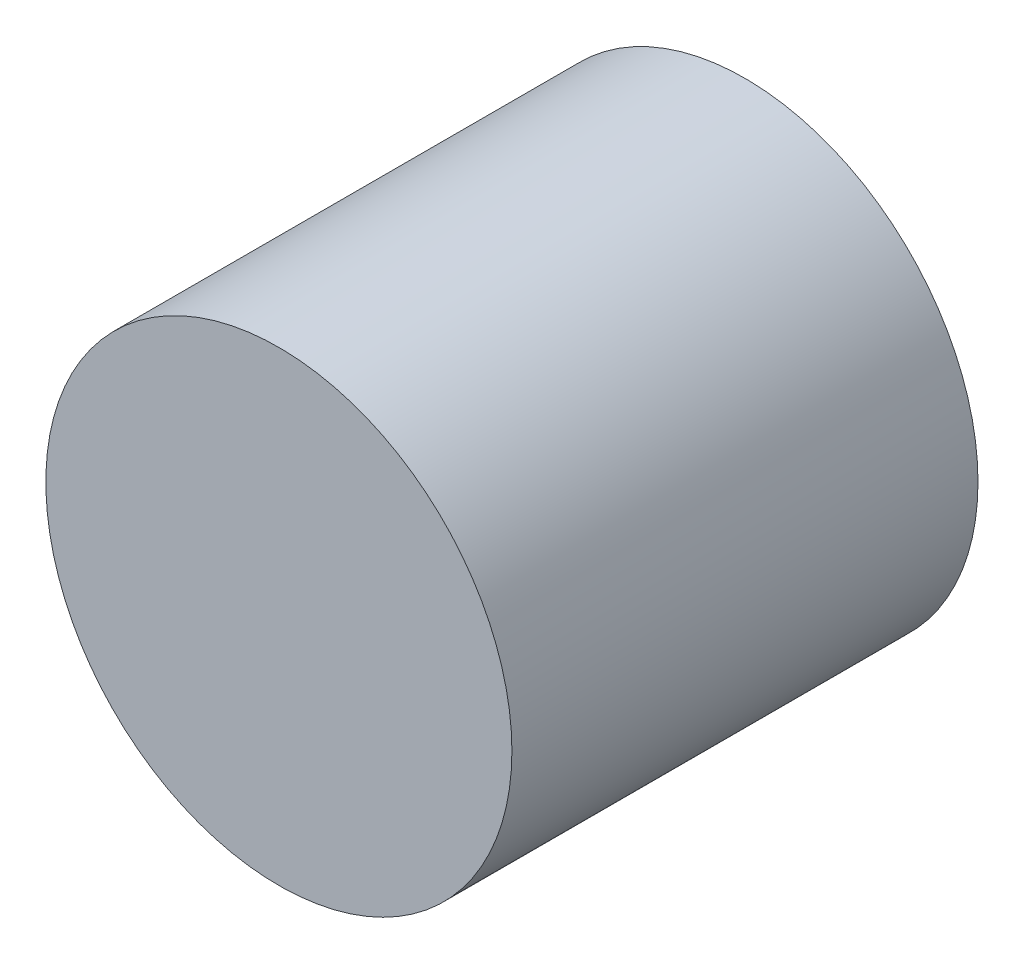
ISO-10303-21;
HEADER;
FILE_DESCRIPTION(('STEP AP214'),'2;1');
FILE_NAME('part.step','',(''),(''),'','','');
FILE_SCHEMA(('AUTOMOTIVE_DESIGN { 1 0 10303 214 1 1 1 1 }'));
ENDSEC;
DATA;
#1=APPLICATION_CONTEXT('core data for automotive mechanical design processes');
#2=APPLICATION_PROTOCOL_DEFINITION('international standard','automotive_design',2000,#1);
#3=PRODUCT_CONTEXT('',#1,'mechanical');
#4=PRODUCT('Part','Part','',(#3));
#5=PRODUCT_RELATED_PRODUCT_CATEGORY('part','',(#4));
#6=PRODUCT_DEFINITION_FORMATION('','',#4);
#7=PRODUCT_DEFINITION_CONTEXT('part definition',#1,'design');
#8=PRODUCT_DEFINITION('design','',#6,#7);
#9=PRODUCT_DEFINITION_SHAPE('','',#8);
#10=(LENGTH_UNIT() NAMED_UNIT(*) SI_UNIT(.MILLI.,.METRE.));
#11=(NAMED_UNIT(*) PLANE_ANGLE_UNIT() SI_UNIT($,.RADIAN.));
#12=(NAMED_UNIT(*) SI_UNIT($,.STERADIAN.) SOLID_ANGLE_UNIT());
#13=UNCERTAINTY_MEASURE_WITH_UNIT(LENGTH_MEASURE(1.E-05),#10,'distance_accuracy_value','');
#14=(GEOMETRIC_REPRESENTATION_CONTEXT(3) GLOBAL_UNCERTAINTY_ASSIGNED_CONTEXT((#13)) GLOBAL_UNIT_ASSIGNED_CONTEXT((#10,
#11,#12)) REPRESENTATION_CONTEXT('',''));
#15=CARTESIAN_POINT('',(0.,0.,0.));
#16=DIRECTION('',(0.,0.,1.));
#17=DIRECTION('',(1.,0.,0.));
#18=AXIS2_PLACEMENT_3D('',#15,#16,#17);
#19=CARTESIAN_POINT('',(0.,0.,7.));
#20=DIRECTION('',(0.,0.,-1.));
#21=DIRECTION('',(-1.,0.,0.));
#22=AXIS2_PLACEMENT_3D('',#19,#20,#21);
#23=CYLINDRICAL_SURFACE('',#22,3.5);
#24=CARTESIAN_POINT('',(0.,0.,7.));
#25=DIRECTION('',(0.,0.,1.));
#26=DIRECTION('',(1.,0.,0.));
#27=AXIS2_PLACEMENT_3D('',#24,#25,#26);
#28=CIRCLE('',#27,3.5);
#29=CARTESIAN_POINT('',(3.5,0.,7.));
#30=VERTEX_POINT('',#29);
#31=EDGE_CURVE('E10',#30,#30,#28,.T.);
#32=ORIENTED_EDGE('',*,*,#31,.F.);
#33=EDGE_LOOP('',(#32));
#34=FACE_BOUND('',#33,.T.);
#35=CARTESIAN_POINT('',(0.,0.,0.));
#36=DIRECTION('',(0.,0.,1.));
#37=DIRECTION('',(1.,0.,0.));
#38=AXIS2_PLACEMENT_3D('',#35,#36,#37);
#39=CIRCLE('',#38,3.5);
#40=CARTESIAN_POINT('',(3.5,0.,0.));
#41=VERTEX_POINT('',#40);
#42=EDGE_CURVE('E44',#41,#41,#39,.T.);
#43=ORIENTED_EDGE('',*,*,#42,.T.);
#44=EDGE_LOOP('',(#43));
#45=FACE_BOUND('',#44,.T.);
#46=ADVANCED_FACE('F41',(#34,#45),#23,.T.);
#47=CARTESIAN_POINT('',(0.,0.,7.));
#48=DIRECTION('',(0.,0.,1.));
#49=DIRECTION('',(1.,0.,0.));
#50=AXIS2_PLACEMENT_3D('',#47,#48,#49);
#51=PLANE('',#50);
#52=ORIENTED_EDGE('',*,*,#31,.T.);
#53=EDGE_LOOP('',(#52));
#54=FACE_BOUND('',#53,.T.);
#55=ADVANCED_FACE('F58',(#54),#51,.T.);
#56=CARTESIAN_POINT('',(0.,0.,0.));
#57=DIRECTION('',(0.,0.,1.));
#58=DIRECTION('',(1.,0.,0.));
#59=AXIS2_PLACEMENT_3D('',#56,#57,#58);
#60=PLANE('',#59);
#61=ORIENTED_EDGE('',*,*,#42,.F.);
#62=EDGE_LOOP('',(#61));
#63=FACE_BOUND('',#62,.T.);
#64=ADVANCED_FACE('F56',(#63),#60,.F.);
#65=CLOSED_SHELL('',(#46,#55,#64));
#66=MANIFOLD_SOLID_BREP('B2',#65);
#67=ADVANCED_BREP_SHAPE_REPRESENTATION('',(#18,#66),#14);
#68=SHAPE_DEFINITION_REPRESENTATION(#9,#67);
ENDSEC;
END-ISO-10303-21;
